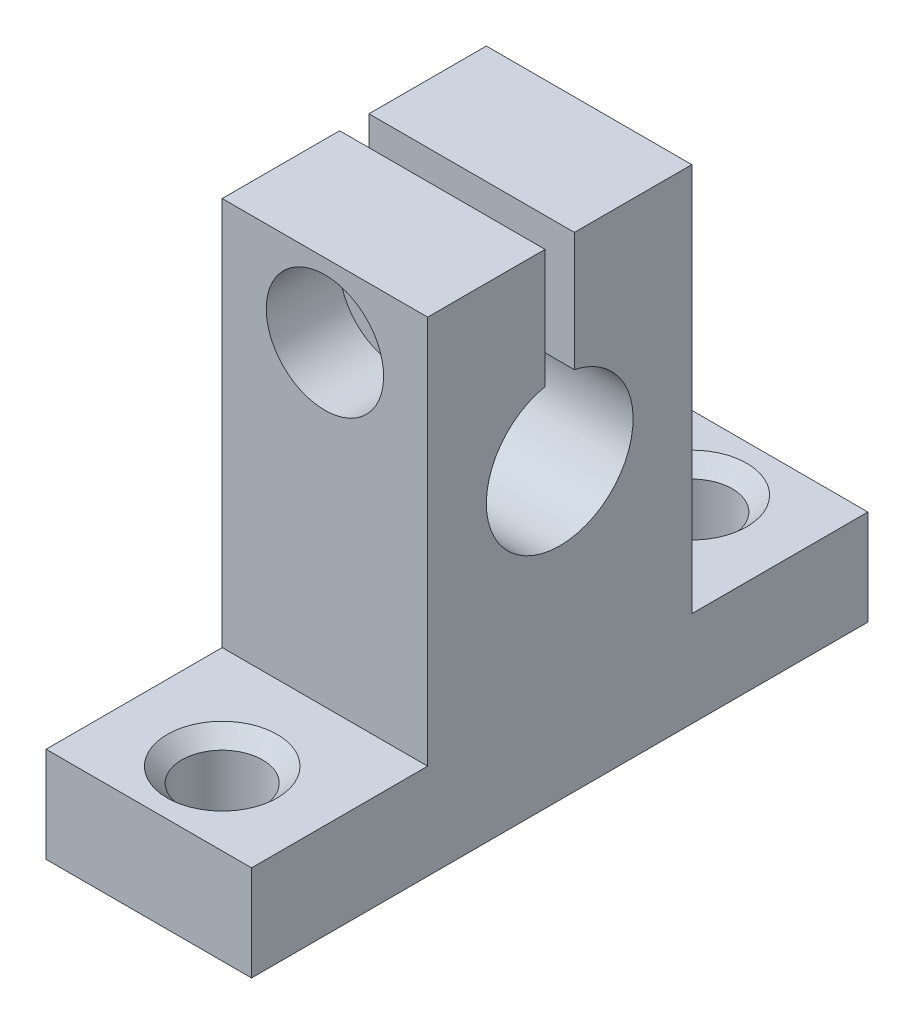
ISO-10303-21;
HEADER;
FILE_DESCRIPTION(('STEP AP214'),'2;1');
FILE_NAME('part.step','',(''),(''),'','','');
FILE_SCHEMA(('AUTOMOTIVE_DESIGN { 1 0 10303 214 1 1 1 1 }'));
ENDSEC;
DATA;
#1=APPLICATION_CONTEXT('core data for automotive mechanical design processes');
#2=APPLICATION_PROTOCOL_DEFINITION('international standard','automotive_design',2000,#1);
#3=PRODUCT_CONTEXT('',#1,'mechanical');
#4=PRODUCT('Part','Part','',(#3));
#5=PRODUCT_RELATED_PRODUCT_CATEGORY('part','',(#4));
#6=PRODUCT_DEFINITION_FORMATION('','',#4);
#7=PRODUCT_DEFINITION_CONTEXT('part definition',#1,'design');
#8=PRODUCT_DEFINITION('design','',#6,#7);
#9=PRODUCT_DEFINITION_SHAPE('','',#8);
#10=(LENGTH_UNIT() NAMED_UNIT(*) SI_UNIT(.MILLI.,.METRE.));
#11=(NAMED_UNIT(*) PLANE_ANGLE_UNIT() SI_UNIT($,.RADIAN.));
#12=(NAMED_UNIT(*) SI_UNIT($,.STERADIAN.) SOLID_ANGLE_UNIT());
#13=UNCERTAINTY_MEASURE_WITH_UNIT(LENGTH_MEASURE(1.E-05),#10,'distance_accuracy_value','');
#14=(GEOMETRIC_REPRESENTATION_CONTEXT(3) GLOBAL_UNCERTAINTY_ASSIGNED_CONTEXT((#13)) GLOBAL_UNIT_ASSIGNED_CONTEXT((#10,
#11,#12)) REPRESENTATION_CONTEXT('',''));
#15=CARTESIAN_POINT('',(0.,0.,0.));
#16=DIRECTION('',(0.,0.,1.));
#17=DIRECTION('',(1.,0.,0.));
#18=AXIS2_PLACEMENT_3D('',#15,#16,#17);
#19=CARTESIAN_POINT('',(7.,28.,-17.));
#20=DIRECTION('',(0.,0.,1.));
#21=DIRECTION('',(0.,-1.,0.));
#22=AXIS2_PLACEMENT_3D('',#19,#20,#21);
#23=PLANE('',#22);
#24=CARTESIAN_POINT('',(7.,28.,-17.));
#25=DIRECTION('',(0.,0.,-1.));
#26=DIRECTION('',(0.,1.,0.));
#27=AXIS2_PLACEMENT_3D('',#24,#25,#26);
#28=CIRCLE('',#27,2.);
#29=CARTESIAN_POINT('',(7.,30.,-17.));
#30=VERTEX_POINT('',#29);
#31=EDGE_CURVE('E18',#30,#30,#28,.T.);
#32=ORIENTED_EDGE('',*,*,#31,.T.);
#33=EDGE_LOOP('',(#32));
#34=FACE_BOUND('',#33,.T.);
#35=CARTESIAN_POINT('',(7.,28.,-17.));
#36=DIRECTION('',(0.,0.,-1.));
#37=DIRECTION('',(0.,1.,0.));
#38=AXIS2_PLACEMENT_3D('',#35,#36,#37);
#39=CIRCLE('',#38,4.);
#40=CARTESIAN_POINT('',(7.,32.,-17.));
#41=VERTEX_POINT('',#40);
#42=EDGE_CURVE('E270',#41,#41,#39,.F.);
#43=ORIENTED_EDGE('',*,*,#42,.T.);
#44=EDGE_LOOP('',(#43));
#45=FACE_BOUND('',#44,.T.);
#46=ADVANCED_FACE('F15',(#34,#45),#23,.T.);
#47=CARTESIAN_POINT('',(7.,28.,-12.));
#48=DIRECTION('',(0.,0.,-1.));
#49=DIRECTION('',(0.,1.,0.));
#50=AXIS2_PLACEMENT_3D('',#47,#48,#49);
#51=CYLINDRICAL_SURFACE('',#50,2.);
#52=CARTESIAN_POINT('',(7.,28.,-20.));
#53=DIRECTION('',(0.,0.,-1.));
#54=DIRECTION('',(0.,1.,0.));
#55=AXIS2_PLACEMENT_3D('',#52,#53,#54);
#56=CIRCLE('',#55,2.);
#57=CARTESIAN_POINT('',(7.,30.,-20.));
#58=VERTEX_POINT('',#57);
#59=EDGE_CURVE('E118',#58,#58,#56,.T.);
#60=ORIENTED_EDGE('',*,*,#59,.T.);
#61=EDGE_LOOP('',(#60));
#62=FACE_BOUND('',#61,.T.);
#63=ORIENTED_EDGE('',*,*,#31,.F.);
#64=EDGE_LOOP('',(#63));
#65=FACE_BOUND('',#64,.T.);
#66=ADVANCED_FACE('F313',(#62,#65),#51,.F.);
#67=CARTESIAN_POINT('',(7.,28.,-12.));
#68=DIRECTION('',(0.,0.,-1.));
#69=DIRECTION('',(0.,1.,0.));
#70=AXIS2_PLACEMENT_3D('',#67,#68,#69);
#71=CYLINDRICAL_SURFACE('',#70,4.);
#72=ORIENTED_EDGE('',*,*,#42,.F.);
#73=EDGE_LOOP('',(#72));
#74=FACE_BOUND('',#73,.T.);
#75=CARTESIAN_POINT('',(7.,28.,-12.));
#76=DIRECTION('',(0.,0.,-1.));
#77=DIRECTION('',(0.,1.,0.));
#78=AXIS2_PLACEMENT_3D('',#75,#76,#77);
#79=CIRCLE('',#78,4.);
#80=CARTESIAN_POINT('',(7.,32.,-12.));
#81=VERTEX_POINT('',#80);
#82=EDGE_CURVE('E233',#81,#81,#79,.T.);
#83=ORIENTED_EDGE('',*,*,#82,.F.);
#84=EDGE_LOOP('',(#83));
#85=FACE_BOUND('',#84,.T.);
#86=ADVANCED_FACE('F315',(#74,#85),#71,.F.);
#87=CARTESIAN_POINT('',(7.,6.50000000001683,-5.));
#88=DIRECTION('',(0.,1.,0.));
#89=DIRECTION('',(0.,0.,1.));
#90=AXIS2_PLACEMENT_3D('',#87,#88,#89);
#91=CONICAL_SURFACE('',#90,3.75000000002001,0.785398163397448);
#92=CARTESIAN_POINT('',(7.,5.5,-5.));
#93=DIRECTION('',(0.,-1.,0.));
#94=DIRECTION('',(0.,0.,-1.));
#95=AXIS2_PLACEMENT_3D('',#92,#93,#94);
#96=CIRCLE('',#95,2.75);
#97=CARTESIAN_POINT('',(7.,5.5,-7.75));
#98=VERTEX_POINT('',#97);
#99=EDGE_CURVE('E267',#98,#98,#96,.T.);
#100=ORIENTED_EDGE('',*,*,#99,.T.);
#101=EDGE_LOOP('',(#100));
#102=FACE_BOUND('',#101,.T.);
#103=CARTESIAN_POINT('',(7.,6.50000000002183,-5.));
#104=DIRECTION('',(0.,1.,0.));
#105=DIRECTION('',(0.,0.,1.));
#106=AXIS2_PLACEMENT_3D('',#103,#104,#105);
#107=CIRCLE('',#106,3.75000000002501);
#108=CARTESIAN_POINT('',(7.,6.50000000002182,-1.24999999997499));
#109=VERTEX_POINT('',#108);
#110=EDGE_CURVE('E225',#109,#109,#107,.F.);
#111=ORIENTED_EDGE('',*,*,#110,.F.);
#112=EDGE_LOOP('',(#111));
#113=FACE_BOUND('',#112,.T.);
#114=ADVANCED_FACE('F322',(#102,#113),#91,.F.);
#115=CARTESIAN_POINT('',(7.,6.5,-5.));
#116=DIRECTION('',(0.,-1.,0.));
#117=DIRECTION('',(0.,0.,-1.));
#118=AXIS2_PLACEMENT_3D('',#115,#116,#117);
#119=CYLINDRICAL_SURFACE('',#118,2.75);
#120=CARTESIAN_POINT('',(7.,0.,-5.));
#121=DIRECTION('',(0.,-1.,0.));
#122=DIRECTION('',(0.,0.,-1.));
#123=AXIS2_PLACEMENT_3D('',#120,#121,#122);
#124=CIRCLE('',#123,2.75);
#125=CARTESIAN_POINT('',(7.,0.,-7.75));
#126=VERTEX_POINT('',#125);
#127=EDGE_CURVE('E203',#126,#126,#124,.F.);
#128=ORIENTED_EDGE('',*,*,#127,.F.);
#129=EDGE_LOOP('',(#128));
#130=FACE_BOUND('',#129,.T.);
#131=ORIENTED_EDGE('',*,*,#99,.F.);
#132=EDGE_LOOP('',(#131));
#133=FACE_BOUND('',#132,.T.);
#134=ADVANCED_FACE('F389',(#130,#133),#119,.F.);
#135=CARTESIAN_POINT('',(7.,6.50000000000002,-37.));
#136=DIRECTION('',(0.,-1.,0.));
#137=DIRECTION('',(0.,0.,-1.));
#138=AXIS2_PLACEMENT_3D('',#135,#136,#137);
#139=CYLINDRICAL_SURFACE('',#138,2.75);
#140=CARTESIAN_POINT('',(7.,0.,-37.));
#141=DIRECTION('',(0.,-1.,0.));
#142=DIRECTION('',(0.,0.,-1.));
#143=AXIS2_PLACEMENT_3D('',#140,#141,#142);
#144=CIRCLE('',#143,2.75);
#145=CARTESIAN_POINT('',(7.,0.,-39.75));
#146=VERTEX_POINT('',#145);
#147=EDGE_CURVE('E260',#146,#146,#144,.F.);
#148=ORIENTED_EDGE('',*,*,#147,.F.);
#149=EDGE_LOOP('',(#148));
#150=FACE_BOUND('',#149,.T.);
#151=CARTESIAN_POINT('',(7.,5.49999999998363,-37.));
#152=DIRECTION('',(0.,1.,0.));
#153=DIRECTION('',(-1.,0.,0.));
#154=AXIS2_PLACEMENT_3D('',#151,#152,#153);
#155=CIRCLE('',#154,2.74999999998681);
#156=CARTESIAN_POINT('',(4.25000000001319,5.49999999998363,-37.));
#157=VERTEX_POINT('',#156);
#158=EDGE_CURVE('E242',#157,#157,#155,.T.);
#159=ORIENTED_EDGE('',*,*,#158,.T.);
#160=EDGE_LOOP('',(#159));
#161=FACE_BOUND('',#160,.T.);
#162=ADVANCED_FACE('F385',(#150,#161),#139,.F.);
#163=CARTESIAN_POINT('',(7.,6.50000000001683,-37.));
#164=DIRECTION('',(0.,1.,0.));
#165=DIRECTION('',(0.,0.,1.));
#166=AXIS2_PLACEMENT_3D('',#163,#164,#165);
#167=CONICAL_SURFACE('',#166,3.75000000002001,0.785398163397448);
#168=ORIENTED_EDGE('',*,*,#158,.F.);
#169=EDGE_LOOP('',(#168));
#170=FACE_BOUND('',#169,.T.);
#171=CARTESIAN_POINT('',(7.,6.50000000002183,-37.));
#172=DIRECTION('',(0.,1.,0.));
#173=DIRECTION('',(0.,0.,1.));
#174=AXIS2_PLACEMENT_3D('',#171,#172,#173);
#175=CIRCLE('',#174,3.75000000002501);
#176=CARTESIAN_POINT('',(7.,6.50000000002183,-33.249999999975));
#177=VERTEX_POINT('',#176);
#178=EDGE_CURVE('E180',#177,#177,#175,.F.);
#179=ORIENTED_EDGE('',*,*,#178,.F.);
#180=EDGE_LOOP('',(#179));
#181=FACE_BOUND('',#180,.T.);
#182=ADVANCED_FACE('F381',(#170,#181),#167,.F.);
#183=CARTESIAN_POINT('',(7.,28.,-12.));
#184=DIRECTION('',(0.,0.,-1.));
#185=DIRECTION('',(0.,1.,0.));
#186=AXIS2_PLACEMENT_3D('',#183,#184,#185);
#187=CYLINDRICAL_SURFACE('',#186,2.);
#188=CARTESIAN_POINT('',(7.,28.,-30.));
#189=DIRECTION('',(0.,0.,-1.));
#190=DIRECTION('',(0.,1.,0.));
#191=AXIS2_PLACEMENT_3D('',#188,#189,#190);
#192=CIRCLE('',#191,2.);
#193=CARTESIAN_POINT('',(7.,30.,-30.));
#194=VERTEX_POINT('',#193);
#195=EDGE_CURVE('E158',#194,#194,#192,.F.);
#196=ORIENTED_EDGE('',*,*,#195,.F.);
#197=EDGE_LOOP('',(#196));
#198=FACE_BOUND('',#197,.T.);
#199=CARTESIAN_POINT('',(7.,28.,-22.));
#200=DIRECTION('',(0.,0.,-1.));
#201=DIRECTION('',(0.,1.,0.));
#202=AXIS2_PLACEMENT_3D('',#199,#200,#201);
#203=CIRCLE('',#202,2.);
#204=CARTESIAN_POINT('',(7.,30.,-22.));
#205=VERTEX_POINT('',#204);
#206=EDGE_CURVE('E145',#205,#205,#203,.F.);
#207=ORIENTED_EDGE('',*,*,#206,.T.);
#208=EDGE_LOOP('',(#207));
#209=FACE_BOUND('',#208,.T.);
#210=ADVANCED_FACE('F378',(#198,#209),#187,.F.);
#211=CARTESIAN_POINT('',(0.,16.5,-21.));
#212=DIRECTION('',(1.,0.,0.));
#213=DIRECTION('',(0.,0.,-1.));
#214=AXIS2_PLACEMENT_3D('',#211,#212,#213);
#215=PLANE('',#214);
#216=CARTESIAN_POINT('',(0.,20.,-21.));
#217=DIRECTION('',(1.,0.,0.));
#218=DIRECTION('',(0.,0.,-1.));
#219=AXIS2_PLACEMENT_3D('',#216,#217,#218);
#220=CIRCLE('',#219,5.);
#221=CARTESIAN_POINT('',(0.,24.8989794855664,-20.));
#222=VERTEX_POINT('',#221);
#223=CARTESIAN_POINT('',(0.,24.8989794855664,-22.));
#224=VERTEX_POINT('',#223);
#225=EDGE_CURVE('E141',#222,#224,#220,.T.);
#226=ORIENTED_EDGE('',*,*,#225,.T.);
#227=DIRECTION('',(0.,1.,0.));
#228=VECTOR('',#227,1.);
#229=CARTESIAN_POINT('',(0.,33.,-22.));
#230=LINE('',#229,#228);
#231=CARTESIAN_POINT('',(0.,33.,-22.));
#232=VERTEX_POINT('',#231);
#233=EDGE_CURVE('E58',#224,#232,#230,.T.);
#234=ORIENTED_EDGE('',*,*,#233,.T.);
#235=DIRECTION('',(0.,0.,1.));
#236=VECTOR('',#235,1.);
#237=CARTESIAN_POINT('',(0.,33.,-30.));
#238=LINE('',#237,#236);
#239=CARTESIAN_POINT('',(0.,33.,-30.));
#240=VERTEX_POINT('',#239);
#241=EDGE_CURVE('E157',#240,#232,#238,.T.);
#242=ORIENTED_EDGE('',*,*,#241,.F.);
#243=DIRECTION('',(0.,1.,0.));
#244=VECTOR('',#243,1.);
#245=CARTESIAN_POINT('',(0.,6.50000000000002,-30.));
#246=LINE('',#245,#244);
#247=CARTESIAN_POINT('',(0.,6.50000000000002,-30.));
#248=VERTEX_POINT('',#247);
#249=EDGE_CURVE('E169',#248,#240,#246,.T.);
#250=ORIENTED_EDGE('',*,*,#249,.F.);
#251=DIRECTION('',(0.,0.,1.));
#252=VECTOR('',#251,1.);
#253=CARTESIAN_POINT('',(0.,6.50000000000002,-42.));
#254=LINE('',#253,#252);
#255=CARTESIAN_POINT('',(0.,6.50000000000002,-42.));
#256=VERTEX_POINT('',#255);
#257=EDGE_CURVE('E181',#256,#248,#254,.T.);
#258=ORIENTED_EDGE('',*,*,#257,.F.);
#259=DIRECTION('',(0.,1.,0.));
#260=VECTOR('',#259,1.);
#261=CARTESIAN_POINT('',(0.,0.,-42.));
#262=LINE('',#261,#260);
#263=CARTESIAN_POINT('',(0.,0.,-42.));
#264=VERTEX_POINT('',#263);
#265=EDGE_CURVE('E192',#264,#256,#262,.T.);
#266=ORIENTED_EDGE('',*,*,#265,.F.);
#267=DIRECTION('',(0.,0.,-1.));
#268=VECTOR('',#267,1.);
#269=CARTESIAN_POINT('',(0.,0.,0.));
#270=LINE('',#269,#268);
#271=CARTESIAN_POINT('',(0.,0.,0.));
#272=VERTEX_POINT('',#271);
#273=EDGE_CURVE('E204',#272,#264,#270,.T.);
#274=ORIENTED_EDGE('',*,*,#273,.F.);
#275=DIRECTION('',(0.,-1.,0.));
#276=VECTOR('',#275,1.);
#277=CARTESIAN_POINT('',(0.,6.5,0.));
#278=LINE('',#277,#276);
#279=CARTESIAN_POINT('',(0.,6.5,0.));
#280=VERTEX_POINT('',#279);
#281=EDGE_CURVE('E215',#280,#272,#278,.T.);
#282=ORIENTED_EDGE('',*,*,#281,.F.);
#283=DIRECTION('',(0.,0.,1.));
#284=VECTOR('',#283,1.);
#285=CARTESIAN_POINT('',(0.,6.50000000000001,-12.));
#286=LINE('',#285,#284);
#287=CARTESIAN_POINT('',(0.,6.50000000000001,-12.));
#288=VERTEX_POINT('',#287);
#289=EDGE_CURVE('E226',#288,#280,#286,.T.);
#290=ORIENTED_EDGE('',*,*,#289,.F.);
#291=DIRECTION('',(0.,-1.,0.));
#292=VECTOR('',#291,1.);
#293=CARTESIAN_POINT('',(0.,33.,-12.));
#294=LINE('',#293,#292);
#295=CARTESIAN_POINT('',(0.,33.,-12.));
#296=VERTEX_POINT('',#295);
#297=EDGE_CURVE('E234',#296,#288,#294,.T.);
#298=ORIENTED_EDGE('',*,*,#297,.F.);
#299=DIRECTION('',(0.,0.,1.));
#300=VECTOR('',#299,1.);
#301=CARTESIAN_POINT('',(0.,33.,-30.));
#302=LINE('',#301,#300);
#303=CARTESIAN_POINT('',(0.,33.,-20.));
#304=VERTEX_POINT('',#303);
#305=EDGE_CURVE('E117',#304,#296,#302,.T.);
#306=ORIENTED_EDGE('',*,*,#305,.F.);
#307=DIRECTION('',(0.,-1.,0.));
#308=VECTOR('',#307,1.);
#309=CARTESIAN_POINT('',(0.,20.633156690442,-20.));
#310=LINE('',#309,#308);
#311=EDGE_CURVE('E52',#304,#222,#310,.T.);
#312=ORIENTED_EDGE('',*,*,#311,.T.);
#313=EDGE_LOOP('',(#226,#234,#242,#250,#258,#266,#274,#282,#290,#298,#306,#312));
#314=FACE_BOUND('',#313,.T.);
#315=ADVANCED_FACE('F374',(#314),#215,.F.);
#316=CARTESIAN_POINT('',(14.,20.633156690442,-20.));
#317=DIRECTION('',(0.,0.,1.));
#318=DIRECTION('',(0.,-1.,0.));
#319=AXIS2_PLACEMENT_3D('',#316,#317,#318);
#320=PLANE('',#319);
#321=ORIENTED_EDGE('',*,*,#59,.F.);
#322=EDGE_LOOP('',(#321));
#323=FACE_BOUND('',#322,.T.);
#324=ORIENTED_EDGE('',*,*,#311,.F.);
#325=DIRECTION('',(1.,0.,0.));
#326=VECTOR('',#325,1.);
#327=CARTESIAN_POINT('',(0.,33.,-20.));
#328=LINE('',#327,#326);
#329=CARTESIAN_POINT('',(14.,33.,-20.));
#330=VERTEX_POINT('',#329);
#331=EDGE_CURVE('E109',#330,#304,#328,.F.);
#332=ORIENTED_EDGE('',*,*,#331,.F.);
#333=DIRECTION('',(0.,1.,0.));
#334=VECTOR('',#333,1.);
#335=CARTESIAN_POINT('',(14.,16.5,-20.));
#336=LINE('',#335,#334);
#337=CARTESIAN_POINT('',(14.,24.8989794855664,-20.));
#338=VERTEX_POINT('',#337);
#339=EDGE_CURVE('E113',#338,#330,#336,.T.);
#340=ORIENTED_EDGE('',*,*,#339,.F.);
#341=DIRECTION('',(1.,0.,0.));
#342=VECTOR('',#341,1.);
#343=CARTESIAN_POINT('',(0.,24.8989794855664,-20.));
#344=LINE('',#343,#342);
#345=EDGE_CURVE('E132',#338,#222,#344,.F.);
#346=ORIENTED_EDGE('',*,*,#345,.T.);
#347=EDGE_LOOP('',(#324,#332,#340,#346));
#348=FACE_BOUND('',#347,.T.);
#349=ADVANCED_FACE('F111',(#323,#348),#320,.F.);
#350=CARTESIAN_POINT('',(0.,33.,-30.));
#351=DIRECTION('',(0.,1.,0.));
#352=DIRECTION('',(0.,0.,1.));
#353=AXIS2_PLACEMENT_3D('',#350,#351,#352);
#354=PLANE('',#353);
#355=DIRECTION('',(1.,0.,0.));
#356=VECTOR('',#355,1.);
#357=CARTESIAN_POINT('',(0.,33.,-12.));
#358=LINE('',#357,#356);
#359=CARTESIAN_POINT('',(14.,33.,-12.));
#360=VERTEX_POINT('',#359);
#361=EDGE_CURVE('E124',#360,#296,#358,.F.);
#362=ORIENTED_EDGE('',*,*,#361,.F.);
#363=DIRECTION('',(0.,0.,-1.));
#364=VECTOR('',#363,1.);
#365=CARTESIAN_POINT('',(14.,33.,-21.));
#366=LINE('',#365,#364);
#367=EDGE_CURVE('E121',#330,#360,#366,.F.);
#368=ORIENTED_EDGE('',*,*,#367,.F.);
#369=ORIENTED_EDGE('',*,*,#331,.T.);
#370=ORIENTED_EDGE('',*,*,#305,.T.);
#371=EDGE_LOOP('',(#362,#368,#369,#370));
#372=FACE_BOUND('',#371,.T.);
#373=ADVANCED_FACE('F122',(#372),#354,.T.);
#374=CARTESIAN_POINT('',(0.,33.,-12.));
#375=DIRECTION('',(0.,0.,1.));
#376=DIRECTION('',(0.,-1.,0.));
#377=AXIS2_PLACEMENT_3D('',#374,#375,#376);
#378=PLANE('',#377);
#379=ORIENTED_EDGE('',*,*,#82,.T.);
#380=EDGE_LOOP('',(#379));
#381=FACE_BOUND('',#380,.T.);
#382=DIRECTION('',(0.,1.,0.));
#383=VECTOR('',#382,1.);
#384=CARTESIAN_POINT('',(14.,16.5,-12.));
#385=LINE('',#384,#383);
#386=CARTESIAN_POINT('',(14.,6.5,-12.));
#387=VERTEX_POINT('',#386);
#388=EDGE_CURVE('E128',#360,#387,#385,.F.);
#389=ORIENTED_EDGE('',*,*,#388,.F.);
#390=ORIENTED_EDGE('',*,*,#361,.T.);
#391=ORIENTED_EDGE('',*,*,#297,.T.);
#392=DIRECTION('',(1.,0.,0.));
#393=VECTOR('',#392,1.);
#394=CARTESIAN_POINT('',(0.,6.50000000000001,-12.));
#395=LINE('',#394,#393);
#396=EDGE_CURVE('E222',#387,#288,#395,.F.);
#397=ORIENTED_EDGE('',*,*,#396,.F.);
#398=EDGE_LOOP('',(#389,#390,#391,#397));
#399=FACE_BOUND('',#398,.T.);
#400=ADVANCED_FACE('F365',(#381,#399),#378,.T.);
#401=CARTESIAN_POINT('',(0.,6.50000000000001,-12.));
#402=DIRECTION('',(0.,1.,0.));
#403=DIRECTION('',(0.,0.,1.));
#404=AXIS2_PLACEMENT_3D('',#401,#402,#403);
#405=PLANE('',#404);
#406=ORIENTED_EDGE('',*,*,#110,.T.);
#407=EDGE_LOOP('',(#406));
#408=FACE_BOUND('',#407,.T.);
#409=DIRECTION('',(0.,0.,-1.));
#410=VECTOR('',#409,1.);
#411=CARTESIAN_POINT('',(14.,6.5,-21.));
#412=LINE('',#411,#410);
#413=CARTESIAN_POINT('',(14.,6.5,0.));
#414=VERTEX_POINT('',#413);
#415=EDGE_CURVE('E209',#387,#414,#412,.F.);
#416=ORIENTED_EDGE('',*,*,#415,.F.);
#417=ORIENTED_EDGE('',*,*,#396,.T.);
#418=ORIENTED_EDGE('',*,*,#289,.T.);
#419=DIRECTION('',(1.,0.,0.));
#420=VECTOR('',#419,1.);
#421=CARTESIAN_POINT('',(0.,6.5,0.));
#422=LINE('',#421,#420);
#423=EDGE_CURVE('E212',#414,#280,#422,.F.);
#424=ORIENTED_EDGE('',*,*,#423,.F.);
#425=EDGE_LOOP('',(#416,#417,#418,#424));
#426=FACE_BOUND('',#425,.T.);
#427=ADVANCED_FACE('F361',(#408,#426),#405,.T.);
#428=CARTESIAN_POINT('',(0.,6.5,0.));
#429=DIRECTION('',(0.,0.,1.));
#430=DIRECTION('',(0.,-1.,0.));
#431=AXIS2_PLACEMENT_3D('',#428,#429,#430);
#432=PLANE('',#431);
#433=DIRECTION('',(0.,1.,0.));
#434=VECTOR('',#433,1.);
#435=CARTESIAN_POINT('',(14.,16.5,0.));
#436=LINE('',#435,#434);
#437=CARTESIAN_POINT('',(14.,0.,0.));
#438=VERTEX_POINT('',#437);
#439=EDGE_CURVE('E197',#414,#438,#436,.F.);
#440=ORIENTED_EDGE('',*,*,#439,.F.);
#441=ORIENTED_EDGE('',*,*,#423,.T.);
#442=ORIENTED_EDGE('',*,*,#281,.T.);
#443=DIRECTION('',(1.,0.,0.));
#444=VECTOR('',#443,1.);
#445=CARTESIAN_POINT('',(0.,0.,0.));
#446=LINE('',#445,#444);
#447=EDGE_CURVE('E200',#438,#272,#446,.F.);
#448=ORIENTED_EDGE('',*,*,#447,.F.);
#449=EDGE_LOOP('',(#440,#441,#442,#448));
#450=FACE_BOUND('',#449,.T.);
#451=ADVANCED_FACE('F357',(#450),#432,.T.);
#452=CARTESIAN_POINT('',(0.,0.,0.));
#453=DIRECTION('',(0.,-1.,0.));
#454=DIRECTION('',(0.,0.,-1.));
#455=AXIS2_PLACEMENT_3D('',#452,#453,#454);
#456=PLANE('',#455);
#457=ORIENTED_EDGE('',*,*,#147,.T.);
#458=EDGE_LOOP('',(#457));
#459=FACE_BOUND('',#458,.T.);
#460=ORIENTED_EDGE('',*,*,#127,.T.);
#461=EDGE_LOOP('',(#460));
#462=FACE_BOUND('',#461,.T.);
#463=DIRECTION('',(0.,0.,-1.));
#464=VECTOR('',#463,1.);
#465=CARTESIAN_POINT('',(14.,0.,-21.));
#466=LINE('',#465,#464);
#467=CARTESIAN_POINT('',(14.,0.,-42.));
#468=VERTEX_POINT('',#467);
#469=EDGE_CURVE('E186',#438,#468,#466,.T.);
#470=ORIENTED_EDGE('',*,*,#469,.F.);
#471=ORIENTED_EDGE('',*,*,#447,.T.);
#472=ORIENTED_EDGE('',*,*,#273,.T.);
#473=DIRECTION('',(-1.,0.,0.));
#474=VECTOR('',#473,1.);
#475=CARTESIAN_POINT('',(0.,0.,-42.));
#476=LINE('',#475,#474);
#477=EDGE_CURVE('E189',#468,#264,#476,.T.);
#478=ORIENTED_EDGE('',*,*,#477,.F.);
#479=EDGE_LOOP('',(#470,#471,#472,#478));
#480=FACE_BOUND('',#479,.T.);
#481=ADVANCED_FACE('F353',(#459,#462,#480),#456,.T.);
#482=CARTESIAN_POINT('',(0.,0.,-42.));
#483=DIRECTION('',(0.,0.,-1.));
#484=DIRECTION('',(-1.,0.,0.));
#485=AXIS2_PLACEMENT_3D('',#482,#483,#484);
#486=PLANE('',#485);
#487=DIRECTION('',(0.,1.,0.));
#488=VECTOR('',#487,1.);
#489=CARTESIAN_POINT('',(14.,16.5,-42.));
#490=LINE('',#489,#488);
#491=CARTESIAN_POINT('',(14.,6.50000000000002,-42.));
#492=VERTEX_POINT('',#491);
#493=EDGE_CURVE('E174',#468,#492,#490,.T.);
#494=ORIENTED_EDGE('',*,*,#493,.F.);
#495=ORIENTED_EDGE('',*,*,#477,.T.);
#496=ORIENTED_EDGE('',*,*,#265,.T.);
#497=DIRECTION('',(1.,0.,0.));
#498=VECTOR('',#497,1.);
#499=CARTESIAN_POINT('',(0.,6.50000000000002,-42.));
#500=LINE('',#499,#498);
#501=EDGE_CURVE('E177',#492,#256,#500,.F.);
#502=ORIENTED_EDGE('',*,*,#501,.F.);
#503=EDGE_LOOP('',(#494,#495,#496,#502));
#504=FACE_BOUND('',#503,.T.);
#505=ADVANCED_FACE('F349',(#504),#486,.T.);
#506=CARTESIAN_POINT('',(0.,6.50000000000002,-42.));
#507=DIRECTION('',(0.,1.,0.));
#508=DIRECTION('',(0.,0.,1.));
#509=AXIS2_PLACEMENT_3D('',#506,#507,#508);
#510=PLANE('',#509);
#511=ORIENTED_EDGE('',*,*,#178,.T.);
#512=EDGE_LOOP('',(#511));
#513=FACE_BOUND('',#512,.T.);
#514=DIRECTION('',(0.,0.,-1.));
#515=VECTOR('',#514,1.);
#516=CARTESIAN_POINT('',(14.,6.50000000000002,-21.));
#517=LINE('',#516,#515);
#518=CARTESIAN_POINT('',(14.,6.50000000000002,-30.));
#519=VERTEX_POINT('',#518);
#520=EDGE_CURVE('E163',#492,#519,#517,.F.);
#521=ORIENTED_EDGE('',*,*,#520,.F.);
#522=ORIENTED_EDGE('',*,*,#501,.T.);
#523=ORIENTED_EDGE('',*,*,#257,.T.);
#524=DIRECTION('',(1.,0.,0.));
#525=VECTOR('',#524,1.);
#526=CARTESIAN_POINT('',(0.,6.50000000000002,-30.));
#527=LINE('',#526,#525);
#528=EDGE_CURVE('E166',#519,#248,#527,.F.);
#529=ORIENTED_EDGE('',*,*,#528,.F.);
#530=EDGE_LOOP('',(#521,#522,#523,#529));
#531=FACE_BOUND('',#530,.T.);
#532=ADVANCED_FACE('F345',(#513,#531),#510,.T.);
#533=CARTESIAN_POINT('',(0.,6.50000000000002,-30.));
#534=DIRECTION('',(0.,0.,-1.));
#535=DIRECTION('',(0.,1.,0.));
#536=AXIS2_PLACEMENT_3D('',#533,#534,#535);
#537=PLANE('',#536);
#538=ORIENTED_EDGE('',*,*,#195,.T.);
#539=EDGE_LOOP('',(#538));
#540=FACE_BOUND('',#539,.T.);
#541=DIRECTION('',(0.,1.,0.));
#542=VECTOR('',#541,1.);
#543=CARTESIAN_POINT('',(14.,16.5,-30.));
#544=LINE('',#543,#542);
#545=CARTESIAN_POINT('',(14.,33.,-30.));
#546=VERTEX_POINT('',#545);
#547=EDGE_CURVE('E151',#519,#546,#544,.T.);
#548=ORIENTED_EDGE('',*,*,#547,.F.);
#549=ORIENTED_EDGE('',*,*,#528,.T.);
#550=ORIENTED_EDGE('',*,*,#249,.T.);
#551=DIRECTION('',(1.,0.,0.));
#552=VECTOR('',#551,1.);
#553=CARTESIAN_POINT('',(0.,33.,-30.));
#554=LINE('',#553,#552);
#555=EDGE_CURVE('E154',#546,#240,#554,.F.);
#556=ORIENTED_EDGE('',*,*,#555,.F.);
#557=EDGE_LOOP('',(#548,#549,#550,#556));
#558=FACE_BOUND('',#557,.T.);
#559=ADVANCED_FACE('F341',(#540,#558),#537,.T.);
#560=CARTESIAN_POINT('',(0.,33.,-30.));
#561=DIRECTION('',(0.,1.,0.));
#562=DIRECTION('',(0.,0.,1.));
#563=AXIS2_PLACEMENT_3D('',#560,#561,#562);
#564=PLANE('',#563);
#565=ORIENTED_EDGE('',*,*,#555,.T.);
#566=ORIENTED_EDGE('',*,*,#241,.T.);
#567=DIRECTION('',(-1.,0.,0.));
#568=VECTOR('',#567,1.);
#569=CARTESIAN_POINT('',(14.,33.,-22.));
#570=LINE('',#569,#568);
#571=CARTESIAN_POINT('',(14.,33.,-22.));
#572=VERTEX_POINT('',#571);
#573=EDGE_CURVE('E143',#232,#572,#570,.F.);
#574=ORIENTED_EDGE('',*,*,#573,.T.);
#575=DIRECTION('',(0.,0.,-1.));
#576=VECTOR('',#575,1.);
#577=CARTESIAN_POINT('',(14.,33.,-21.));
#578=LINE('',#577,#576);
#579=EDGE_CURVE('E148',#546,#572,#578,.F.);
#580=ORIENTED_EDGE('',*,*,#579,.F.);
#581=EDGE_LOOP('',(#565,#566,#574,#580));
#582=FACE_BOUND('',#581,.T.);
#583=ADVANCED_FACE('F337',(#582),#564,.T.);
#584=CARTESIAN_POINT('',(14.,33.,-22.));
#585=DIRECTION('',(0.,0.,-1.));
#586=DIRECTION('',(-1.,0.,0.));
#587=AXIS2_PLACEMENT_3D('',#584,#585,#586);
#588=PLANE('',#587);
#589=ORIENTED_EDGE('',*,*,#206,.F.);
#590=EDGE_LOOP('',(#589));
#591=FACE_BOUND('',#590,.T.);
#592=DIRECTION('',(0.,1.,0.));
#593=VECTOR('',#592,1.);
#594=CARTESIAN_POINT('',(14.,16.5,-22.));
#595=LINE('',#594,#593);
#596=CARTESIAN_POINT('',(14.,24.8989794855664,-22.));
#597=VERTEX_POINT('',#596);
#598=EDGE_CURVE('E24',#572,#597,#595,.F.);
#599=ORIENTED_EDGE('',*,*,#598,.F.);
#600=ORIENTED_EDGE('',*,*,#573,.F.);
#601=ORIENTED_EDGE('',*,*,#233,.F.);
#602=DIRECTION('',(1.,0.,0.));
#603=VECTOR('',#602,1.);
#604=CARTESIAN_POINT('',(0.,24.8989794855664,-22.));
#605=LINE('',#604,#603);
#606=EDGE_CURVE('E33',#224,#597,#605,.T.);
#607=ORIENTED_EDGE('',*,*,#606,.T.);
#608=EDGE_LOOP('',(#599,#600,#601,#607));
#609=FACE_BOUND('',#608,.T.);
#610=ADVANCED_FACE('F331',(#591,#609),#588,.F.);
#611=CARTESIAN_POINT('',(0.,20.,-21.));
#612=DIRECTION('',(1.,0.,0.));
#613=DIRECTION('',(0.,0.,-1.));
#614=AXIS2_PLACEMENT_3D('',#611,#612,#613);
#615=CYLINDRICAL_SURFACE('',#614,5.);
#616=CARTESIAN_POINT('',(14.,20.,-21.));
#617=DIRECTION('',(1.,0.,0.));
#618=DIRECTION('',(0.,0.,-1.));
#619=AXIS2_PLACEMENT_3D('',#616,#617,#618);
#620=CIRCLE('',#619,5.);
#621=EDGE_CURVE('E9',#597,#338,#620,.F.);
#622=ORIENTED_EDGE('',*,*,#621,.F.);
#623=ORIENTED_EDGE('',*,*,#606,.F.);
#624=ORIENTED_EDGE('',*,*,#225,.F.);
#625=ORIENTED_EDGE('',*,*,#345,.F.);
#626=EDGE_LOOP('',(#622,#623,#624,#625));
#627=FACE_BOUND('',#626,.T.);
#628=ADVANCED_FACE('F326',(#627),#615,.F.);
#629=CARTESIAN_POINT('',(14.,16.5,-21.));
#630=DIRECTION('',(1.,0.,0.));
#631=DIRECTION('',(0.,0.,-1.));
#632=AXIS2_PLACEMENT_3D('',#629,#630,#631);
#633=PLANE('',#632);
#634=ORIENTED_EDGE('',*,*,#598,.T.);
#635=ORIENTED_EDGE('',*,*,#621,.T.);
#636=ORIENTED_EDGE('',*,*,#339,.T.);
#637=ORIENTED_EDGE('',*,*,#367,.T.);
#638=ORIENTED_EDGE('',*,*,#388,.T.);
#639=ORIENTED_EDGE('',*,*,#415,.T.);
#640=ORIENTED_EDGE('',*,*,#439,.T.);
#641=ORIENTED_EDGE('',*,*,#469,.T.);
#642=ORIENTED_EDGE('',*,*,#493,.T.);
#643=ORIENTED_EDGE('',*,*,#520,.T.);
#644=ORIENTED_EDGE('',*,*,#547,.T.);
#645=ORIENTED_EDGE('',*,*,#579,.T.);
#646=EDGE_LOOP('',(#634,#635,#636,#637,#638,#639,#640,#641,#642,#643,#644,#645));
#647=FACE_BOUND('',#646,.T.);
#648=ADVANCED_FACE('F131',(#647),#633,.T.);
#649=CLOSED_SHELL('',(#46,#66,#86,#114,#134,#162,#182,#210,#315,#349,#373,#400,#427,#451,#481,
#505,#532,#559,#583,#610,#628,#648));
#650=MANIFOLD_SOLID_BREP('B1',#649);
#651=ADVANCED_BREP_SHAPE_REPRESENTATION('',(#18,#650),#14);
#652=SHAPE_DEFINITION_REPRESENTATION(#9,#651);
ENDSEC;
END-ISO-10303-21;
